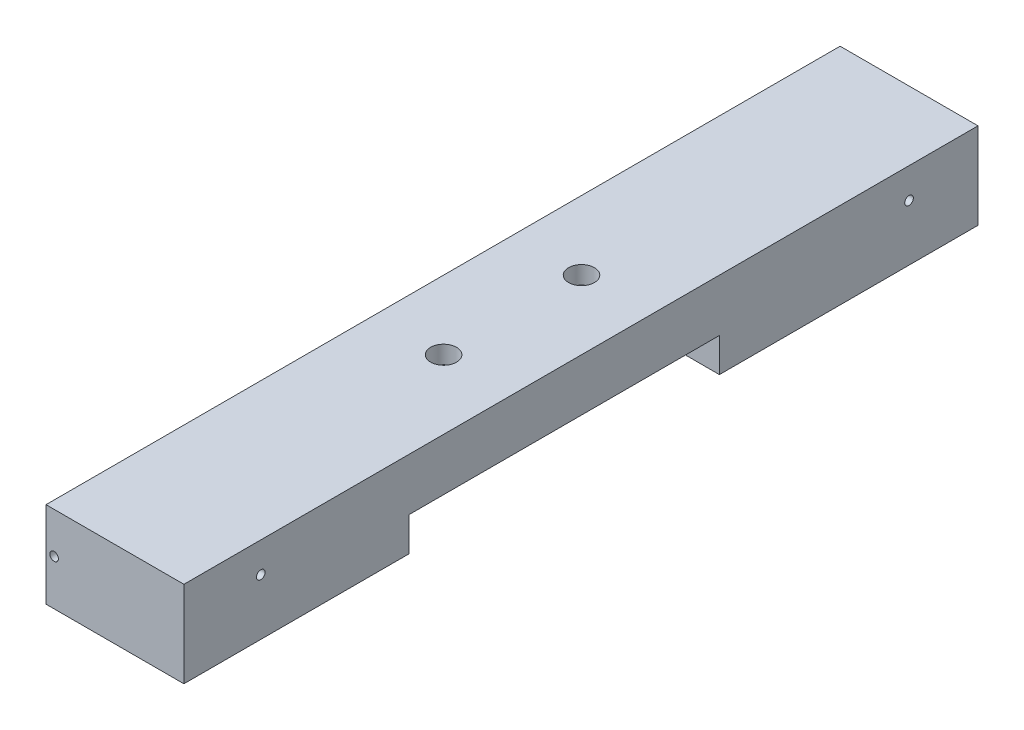
ISO-10303-21;
HEADER;
FILE_DESCRIPTION(('STEP AP214'),'2;1');
FILE_NAME('part.step','',(''),(''),'','','');
FILE_SCHEMA(('AUTOMOTIVE_DESIGN { 1 0 10303 214 1 1 1 1 }'));
ENDSEC;
DATA;
#1=APPLICATION_CONTEXT('core data for automotive mechanical design processes');
#2=APPLICATION_PROTOCOL_DEFINITION('international standard','automotive_design',2000,#1);
#3=PRODUCT_CONTEXT('',#1,'mechanical');
#4=PRODUCT('Part','Part','',(#3));
#5=PRODUCT_RELATED_PRODUCT_CATEGORY('part','',(#4));
#6=PRODUCT_DEFINITION_FORMATION('','',#4);
#7=PRODUCT_DEFINITION_CONTEXT('part definition',#1,'design');
#8=PRODUCT_DEFINITION('design','',#6,#7);
#9=PRODUCT_DEFINITION_SHAPE('','',#8);
#10=(LENGTH_UNIT() NAMED_UNIT(*) SI_UNIT(.MILLI.,.METRE.));
#11=(NAMED_UNIT(*) PLANE_ANGLE_UNIT() SI_UNIT($,.RADIAN.));
#12=(NAMED_UNIT(*) SI_UNIT($,.STERADIAN.) SOLID_ANGLE_UNIT());
#13=UNCERTAINTY_MEASURE_WITH_UNIT(LENGTH_MEASURE(1.E-05),#10,'distance_accuracy_value','');
#14=(GEOMETRIC_REPRESENTATION_CONTEXT(3) GLOBAL_UNCERTAINTY_ASSIGNED_CONTEXT((#13)) GLOBAL_UNIT_ASSIGNED_CONTEXT((#10,
#11,#12)) REPRESENTATION_CONTEXT('',''));
#15=CARTESIAN_POINT('',(0.,0.,0.));
#16=DIRECTION('',(0.,0.,1.));
#17=DIRECTION('',(1.,0.,0.));
#18=AXIS2_PLACEMENT_3D('',#15,#16,#17);
#19=CARTESIAN_POINT('',(50.8,63.5,241.3));
#20=DIRECTION('',(0.,-1.,0.));
#21=DIRECTION('',(0.,0.,-1.));
#22=AXIS2_PLACEMENT_3D('',#19,#20,#21);
#23=CYLINDRICAL_SURFACE('',#22,4.93435191606347);
#24=CARTESIAN_POINT('',(50.8,24.9999999999998,241.3));
#25=DIRECTION('',(0.,-1.,0.));
#26=DIRECTION('',(0.,0.,-1.));
#27=AXIS2_PLACEMENT_3D('',#24,#25,#26);
#28=CIRCLE('',#27,4.93435191606347);
#29=CARTESIAN_POINT('',(50.8,24.9999999999998,236.365648083937));
#30=VERTEX_POINT('',#29);
#31=EDGE_CURVE('E165',#30,#30,#28,.T.);
#32=ORIENTED_EDGE('',*,*,#31,.T.);
#33=EDGE_LOOP('',(#32));
#34=FACE_BOUND('',#33,.T.);
#35=CARTESIAN_POINT('',(50.8,50.4000000000003,241.3));
#36=DIRECTION('',(0.,1.,0.));
#37=DIRECTION('',(-1.,0.,0.));
#38=AXIS2_PLACEMENT_3D('',#35,#36,#37);
#39=CIRCLE('',#38,4.93435191606347);
#40=CARTESIAN_POINT('',(45.8656480839365,50.4000000000003,241.3));
#41=VERTEX_POINT('',#40);
#42=EDGE_CURVE('E39',#41,#41,#39,.F.);
#43=ORIENTED_EDGE('',*,*,#42,.F.);
#44=EDGE_LOOP('',(#43));
#45=FACE_BOUND('',#44,.T.);
#46=ADVANCED_FACE('F35',(#34,#45),#23,.F.);
#47=CARTESIAN_POINT('',(50.8,63.5,342.9));
#48=DIRECTION('',(0.,-1.,0.));
#49=DIRECTION('',(0.,0.,-1.));
#50=AXIS2_PLACEMENT_3D('',#47,#48,#49);
#51=CYLINDRICAL_SURFACE('',#50,4.93435191606347);
#52=CARTESIAN_POINT('',(50.8,24.9999999999998,342.9));
#53=DIRECTION('',(0.,-1.,0.));
#54=DIRECTION('',(0.,0.,-1.));
#55=AXIS2_PLACEMENT_3D('',#52,#53,#54);
#56=CIRCLE('',#55,4.93435191606347);
#57=CARTESIAN_POINT('',(50.8,24.9999999999998,337.965648083937));
#58=VERTEX_POINT('',#57);
#59=EDGE_CURVE('E174',#58,#58,#56,.T.);
#60=ORIENTED_EDGE('',*,*,#59,.T.);
#61=EDGE_LOOP('',(#60));
#62=FACE_BOUND('',#61,.T.);
#63=CARTESIAN_POINT('',(50.8,50.4000000000003,342.9));
#64=DIRECTION('',(0.,1.,0.));
#65=DIRECTION('',(-1.,0.,0.));
#66=AXIS2_PLACEMENT_3D('',#63,#64,#65);
#67=CIRCLE('',#66,4.93435191606347);
#68=CARTESIAN_POINT('',(45.8656480839365,50.4000000000003,342.9));
#69=VERTEX_POINT('',#68);
#70=EDGE_CURVE('E135',#69,#69,#67,.F.);
#71=ORIENTED_EDGE('',*,*,#70,.F.);
#72=EDGE_LOOP('',(#71));
#73=FACE_BOUND('',#72,.T.);
#74=ADVANCED_FACE('F330',(#62,#73),#51,.F.);
#75=CARTESIAN_POINT('',(0.,0.,585.0001));
#76=DIRECTION('',(0.,1.,0.));
#77=DIRECTION('',(0.,0.,1.));
#78=AXIS2_PLACEMENT_3D('',#75,#76,#77);
#79=PLANE('',#78);
#80=DIRECTION('',(0.,0.,-1.));
#81=VECTOR('',#80,1.);
#82=CARTESIAN_POINT('',(101.6,0.,585.0001));
#83=LINE('',#82,#81);
#84=CARTESIAN_POINT('',(101.6,0.,190.5));
#85=VERTEX_POINT('',#84);
#86=CARTESIAN_POINT('',(101.6,0.,0.));
#87=VERTEX_POINT('',#86);
#88=EDGE_CURVE('E130',#85,#87,#83,.T.);
#89=ORIENTED_EDGE('',*,*,#88,.F.);
#90=DIRECTION('',(-1.,0.,0.));
#91=VECTOR('',#90,1.);
#92=CARTESIAN_POINT('',(101.6,0.,190.5));
#93=LINE('',#92,#91);
#94=CARTESIAN_POINT('',(0.,0.,190.5));
#95=VERTEX_POINT('',#94);
#96=EDGE_CURVE('E278',#85,#95,#93,.T.);
#97=ORIENTED_EDGE('',*,*,#96,.T.);
#98=DIRECTION('',(0.,0.,-1.));
#99=VECTOR('',#98,1.);
#100=CARTESIAN_POINT('',(0.,0.,585.0001));
#101=LINE('',#100,#99);
#102=CARTESIAN_POINT('',(0.,0.,0.));
#103=VERTEX_POINT('',#102);
#104=EDGE_CURVE('E44',#95,#103,#101,.T.);
#105=ORIENTED_EDGE('',*,*,#104,.T.);
#106=DIRECTION('',(1.,0.,0.));
#107=VECTOR('',#106,1.);
#108=CARTESIAN_POINT('',(0.,0.,0.));
#109=LINE('',#108,#107);
#110=EDGE_CURVE('E293',#103,#87,#109,.T.);
#111=ORIENTED_EDGE('',*,*,#110,.T.);
#112=EDGE_LOOP('',(#89,#97,#105,#111));
#113=FACE_BOUND('',#112,.T.);
#114=ADVANCED_FACE('F311',(#113),#79,.F.);
#115=CARTESIAN_POINT('',(0.,0.,585.0001));
#116=DIRECTION('',(1.,0.,0.));
#117=DIRECTION('',(0.,0.,-1.));
#118=AXIS2_PLACEMENT_3D('',#115,#116,#117);
#119=PLANE('',#118);
#120=CARTESIAN_POINT('',(0.,56.5000000000009,566.000000000002));
#121=DIRECTION('',(1.,0.,0.));
#122=DIRECTION('',(0.,0.,-1.));
#123=AXIS2_PLACEMENT_3D('',#120,#121,#122);
#124=CIRCLE('',#123,3.30000000000003);
#125=CARTESIAN_POINT('',(0.,56.5000000000009,562.700000000002));
#126=VERTEX_POINT('',#125);
#127=EDGE_CURVE('E183',#126,#126,#124,.T.);
#128=ORIENTED_EDGE('',*,*,#127,.T.);
#129=EDGE_LOOP('',(#128));
#130=FACE_BOUND('',#129,.T.);
#131=CARTESIAN_POINT('',(0.,10.5000000000009,566.000000000002));
#132=DIRECTION('',(1.,0.,0.));
#133=DIRECTION('',(0.,0.,-1.));
#134=AXIS2_PLACEMENT_3D('',#131,#132,#133);
#135=CIRCLE('',#134,3.30000000000003);
#136=CARTESIAN_POINT('',(0.,10.5000000000009,562.700000000002));
#137=VERTEX_POINT('',#136);
#138=EDGE_CURVE('E190',#137,#137,#135,.T.);
#139=ORIENTED_EDGE('',*,*,#138,.T.);
#140=EDGE_LOOP('',(#139));
#141=FACE_BOUND('',#140,.T.);
#142=CARTESIAN_POINT('',(0.,10.5000000000009,579.000000000002));
#143=DIRECTION('',(1.,0.,0.));
#144=DIRECTION('',(0.,0.,-1.));
#145=AXIS2_PLACEMENT_3D('',#142,#143,#144);
#146=CIRCLE('',#145,3.30000000000003);
#147=CARTESIAN_POINT('',(0.,10.5000000000009,575.700000000002));
#148=VERTEX_POINT('',#147);
#149=EDGE_CURVE('E189',#148,#148,#146,.T.);
#150=ORIENTED_EDGE('',*,*,#149,.T.);
#151=EDGE_LOOP('',(#150));
#152=FACE_BOUND('',#151,.T.);
#153=CARTESIAN_POINT('',(0.,56.500000000001,10.000000000002));
#154=DIRECTION('',(1.,0.,0.));
#155=DIRECTION('',(0.,0.,-1.));
#156=AXIS2_PLACEMENT_3D('',#153,#154,#155);
#157=CIRCLE('',#156,3.3);
#158=CARTESIAN_POINT('',(0.,56.500000000001,6.70000000000199));
#159=VERTEX_POINT('',#158);
#160=EDGE_CURVE('E202',#159,#159,#157,.T.);
#161=ORIENTED_EDGE('',*,*,#160,.T.);
#162=EDGE_LOOP('',(#161));
#163=FACE_BOUND('',#162,.T.);
#164=CARTESIAN_POINT('',(0.,56.5000000000009,579.000000000002));
#165=DIRECTION('',(1.,0.,0.));
#166=DIRECTION('',(0.,0.,-1.));
#167=AXIS2_PLACEMENT_3D('',#164,#165,#166);
#168=CIRCLE('',#167,3.30000000000003);
#169=CARTESIAN_POINT('',(0.,56.5000000000009,575.700000000002));
#170=VERTEX_POINT('',#169);
#171=EDGE_CURVE('E177',#170,#170,#168,.T.);
#172=ORIENTED_EDGE('',*,*,#171,.T.);
#173=EDGE_LOOP('',(#172));
#174=FACE_BOUND('',#173,.T.);
#175=CARTESIAN_POINT('',(0.,10.500000000001,10.000000000002));
#176=DIRECTION('',(1.,0.,0.));
#177=DIRECTION('',(0.,0.,-1.));
#178=AXIS2_PLACEMENT_3D('',#175,#176,#177);
#179=CIRCLE('',#178,3.3);
#180=CARTESIAN_POINT('',(0.,10.500000000001,6.700000000002));
#181=VERTEX_POINT('',#180);
#182=EDGE_CURVE('E201',#181,#181,#179,.T.);
#183=ORIENTED_EDGE('',*,*,#182,.T.);
#184=EDGE_LOOP('',(#183));
#185=FACE_BOUND('',#184,.T.);
#186=CARTESIAN_POINT('',(0.,33.5000000000001,530.000000000002));
#187=DIRECTION('',(1.,0.,0.));
#188=DIRECTION('',(0.,0.,-1.));
#189=AXIS2_PLACEMENT_3D('',#186,#187,#188);
#190=CIRCLE('',#189,1.75);
#191=CARTESIAN_POINT('',(0.,33.5000000000001,528.250000000002));
#192=VERTEX_POINT('',#191);
#193=EDGE_CURVE('E220',#192,#192,#190,.T.);
#194=ORIENTED_EDGE('',*,*,#193,.T.);
#195=EDGE_LOOP('',(#194));
#196=FACE_BOUND('',#195,.T.);
#197=CARTESIAN_POINT('',(0.,33.5000000000001,470.000000000002));
#198=DIRECTION('',(1.,0.,0.));
#199=DIRECTION('',(0.,0.,-1.));
#200=AXIS2_PLACEMENT_3D('',#197,#198,#199);
#201=CIRCLE('',#200,1.75);
#202=CARTESIAN_POINT('',(0.,33.5000000000001,468.250000000002));
#203=VERTEX_POINT('',#202);
#204=EDGE_CURVE('E223',#203,#203,#201,.T.);
#205=ORIENTED_EDGE('',*,*,#204,.T.);
#206=EDGE_LOOP('',(#205));
#207=FACE_BOUND('',#206,.T.);
#208=CARTESIAN_POINT('',(0.,33.5000000000001,410.000000000002));
#209=DIRECTION('',(1.,0.,0.));
#210=DIRECTION('',(0.,0.,-1.));
#211=AXIS2_PLACEMENT_3D('',#208,#209,#210);
#212=CIRCLE('',#211,1.75);
#213=CARTESIAN_POINT('',(0.,33.5000000000001,408.250000000002));
#214=VERTEX_POINT('',#213);
#215=EDGE_CURVE('E229',#214,#214,#212,.T.);
#216=ORIENTED_EDGE('',*,*,#215,.T.);
#217=EDGE_LOOP('',(#216));
#218=FACE_BOUND('',#217,.T.);
#219=CARTESIAN_POINT('',(0.,33.5000000000001,350.000000000002));
#220=DIRECTION('',(1.,0.,0.));
#221=DIRECTION('',(0.,0.,-1.));
#222=AXIS2_PLACEMENT_3D('',#219,#220,#221);
#223=CIRCLE('',#222,1.75);
#224=CARTESIAN_POINT('',(0.,33.5000000000001,348.250000000002));
#225=VERTEX_POINT('',#224);
#226=EDGE_CURVE('E235',#225,#225,#223,.T.);
#227=ORIENTED_EDGE('',*,*,#226,.T.);
#228=EDGE_LOOP('',(#227));
#229=FACE_BOUND('',#228,.T.);
#230=CARTESIAN_POINT('',(0.,33.5000000000001,290.000000000002));
#231=DIRECTION('',(1.,0.,0.));
#232=DIRECTION('',(0.,0.,-1.));
#233=AXIS2_PLACEMENT_3D('',#230,#231,#232);
#234=CIRCLE('',#233,1.75);
#235=CARTESIAN_POINT('',(0.,33.5000000000001,288.250000000002));
#236=VERTEX_POINT('',#235);
#237=EDGE_CURVE('E241',#236,#236,#234,.T.);
#238=ORIENTED_EDGE('',*,*,#237,.T.);
#239=EDGE_LOOP('',(#238));
#240=FACE_BOUND('',#239,.T.);
#241=CARTESIAN_POINT('',(0.,33.5000000000001,230.000000000002));
#242=DIRECTION('',(1.,0.,0.));
#243=DIRECTION('',(0.,0.,-1.));
#244=AXIS2_PLACEMENT_3D('',#241,#242,#243);
#245=CIRCLE('',#244,1.75);
#246=CARTESIAN_POINT('',(0.,33.5000000000001,228.250000000002));
#247=VERTEX_POINT('',#246);
#248=EDGE_CURVE('E247',#247,#247,#245,.T.);
#249=ORIENTED_EDGE('',*,*,#248,.T.);
#250=EDGE_LOOP('',(#249));
#251=FACE_BOUND('',#250,.T.);
#252=CARTESIAN_POINT('',(0.,33.5000000000001,170.000000000002));
#253=DIRECTION('',(1.,0.,0.));
#254=DIRECTION('',(0.,0.,-1.));
#255=AXIS2_PLACEMENT_3D('',#252,#253,#254);
#256=CIRCLE('',#255,1.75);
#257=CARTESIAN_POINT('',(0.,33.5000000000001,168.250000000002));
#258=VERTEX_POINT('',#257);
#259=EDGE_CURVE('E253',#258,#258,#256,.T.);
#260=ORIENTED_EDGE('',*,*,#259,.T.);
#261=EDGE_LOOP('',(#260));
#262=FACE_BOUND('',#261,.T.);
#263=CARTESIAN_POINT('',(0.,33.5000000000001,110.000000000002));
#264=DIRECTION('',(1.,0.,0.));
#265=DIRECTION('',(0.,0.,-1.));
#266=AXIS2_PLACEMENT_3D('',#263,#264,#265);
#267=CIRCLE('',#266,1.75);
#268=CARTESIAN_POINT('',(0.,33.5000000000001,108.250000000002));
#269=VERTEX_POINT('',#268);
#270=EDGE_CURVE('E259',#269,#269,#267,.T.);
#271=ORIENTED_EDGE('',*,*,#270,.T.);
#272=EDGE_LOOP('',(#271));
#273=FACE_BOUND('',#272,.T.);
#274=CARTESIAN_POINT('',(0.,33.5000000000001,50.0000000000019));
#275=DIRECTION('',(1.,0.,0.));
#276=DIRECTION('',(0.,0.,-1.));
#277=AXIS2_PLACEMENT_3D('',#274,#275,#276);
#278=CIRCLE('',#277,1.75);
#279=CARTESIAN_POINT('',(0.,33.5000000000001,48.2500000000019));
#280=VERTEX_POINT('',#279);
#281=EDGE_CURVE('E265',#280,#280,#278,.T.);
#282=ORIENTED_EDGE('',*,*,#281,.T.);
#283=EDGE_LOOP('',(#282));
#284=FACE_BOUND('',#283,.T.);
#285=ORIENTED_EDGE('',*,*,#104,.F.);
#286=DIRECTION('',(0.,-1.,0.));
#287=VECTOR('',#286,1.);
#288=CARTESIAN_POINT('',(0.,0.,190.5));
#289=LINE('',#288,#287);
#290=CARTESIAN_POINT('',(0.,24.9999999999998,190.5));
#291=VERTEX_POINT('',#290);
#292=EDGE_CURVE('E119',#291,#95,#289,.T.);
#293=ORIENTED_EDGE('',*,*,#292,.F.);
#294=DIRECTION('',(0.,0.,-1.));
#295=VECTOR('',#294,1.);
#296=CARTESIAN_POINT('',(0.,24.9999999999998,190.5));
#297=LINE('',#296,#295);
#298=CARTESIAN_POINT('',(0.,24.9999999999998,419.1));
#299=VERTEX_POINT('',#298);
#300=EDGE_CURVE('E274',#299,#291,#297,.T.);
#301=ORIENTED_EDGE('',*,*,#300,.F.);
#302=DIRECTION('',(0.,1.,0.));
#303=VECTOR('',#302,1.);
#304=CARTESIAN_POINT('',(0.,24.9999999999998,419.1));
#305=LINE('',#304,#303);
#306=CARTESIAN_POINT('',(0.,0.,419.1));
#307=VERTEX_POINT('',#306);
#308=EDGE_CURVE('E219',#307,#299,#305,.T.);
#309=ORIENTED_EDGE('',*,*,#308,.F.);
#310=CARTESIAN_POINT('',(0.,0.,585.0001));
#311=VERTEX_POINT('',#310);
#312=EDGE_CURVE('E11',#311,#307,#101,.T.);
#313=ORIENTED_EDGE('',*,*,#312,.F.);
#314=DIRECTION('',(0.,-1.,0.));
#315=VECTOR('',#314,1.);
#316=CARTESIAN_POINT('',(0.,0.,585.0001));
#317=LINE('',#316,#315);
#318=CARTESIAN_POINT('',(0.,63.5,585.0001));
#319=VERTEX_POINT('',#318);
#320=EDGE_CURVE('E285',#319,#311,#317,.T.);
#321=ORIENTED_EDGE('',*,*,#320,.F.);
#322=DIRECTION('',(0.,0.,-1.));
#323=VECTOR('',#322,1.);
#324=CARTESIAN_POINT('',(0.,63.5,585.0001));
#325=LINE('',#324,#323);
#326=CARTESIAN_POINT('',(0.,63.5,0.));
#327=VERTEX_POINT('',#326);
#328=EDGE_CURVE('E290',#319,#327,#325,.T.);
#329=ORIENTED_EDGE('',*,*,#328,.T.);
#330=DIRECTION('',(0.,-1.,0.));
#331=VECTOR('',#330,1.);
#332=CARTESIAN_POINT('',(0.,0.,0.));
#333=LINE('',#332,#331);
#334=EDGE_CURVE('E281',#327,#103,#333,.T.);
#335=ORIENTED_EDGE('',*,*,#334,.T.);
#336=EDGE_LOOP('',(#285,#293,#301,#309,#313,#321,#329,#335));
#337=FACE_BOUND('',#336,.T.);
#338=ADVANCED_FACE('F37',(#130,#141,#152,#163,#174,#185,#196,#207,#218,#229,#240,#251,#262,#273,
#284,#337),#119,.F.);
#339=ORIENTED_EDGE('',*,*,#312,.T.);
#340=DIRECTION('',(-1.,0.,0.));
#341=VECTOR('',#340,1.);
#342=CARTESIAN_POINT('',(101.6,0.,419.1));
#343=LINE('',#342,#341);
#344=CARTESIAN_POINT('',(101.6,0.,419.1));
#345=VERTEX_POINT('',#344);
#346=EDGE_CURVE('E114',#345,#307,#343,.T.);
#347=ORIENTED_EDGE('',*,*,#346,.F.);
#348=CARTESIAN_POINT('',(101.6,0.,585.0001));
#349=VERTEX_POINT('',#348);
#350=EDGE_CURVE('E122',#349,#345,#83,.T.);
#351=ORIENTED_EDGE('',*,*,#350,.F.);
#352=DIRECTION('',(1.,0.,0.));
#353=VECTOR('',#352,1.);
#354=CARTESIAN_POINT('',(0.,0.,585.0001));
#355=LINE('',#354,#353);
#356=EDGE_CURVE('E89',#311,#349,#355,.T.);
#357=ORIENTED_EDGE('',*,*,#356,.F.);
#358=EDGE_LOOP('',(#339,#347,#351,#357));
#359=FACE_BOUND('',#358,.T.);
#360=ADVANCED_FACE('F121',(#359),#79,.F.);
#361=CARTESIAN_POINT('',(101.6,0.,585.0001));
#362=DIRECTION('',(-1.,0.,0.));
#363=DIRECTION('',(0.,0.,1.));
#364=AXIS2_PLACEMENT_3D('',#361,#362,#363);
#365=PLANE('',#364);
#366=CARTESIAN_POINT('',(101.6,41.2873800000008,50.8022026598419));
#367=DIRECTION('',(1.,0.,0.));
#368=DIRECTION('',(0.,0.,-1.));
#369=AXIS2_PLACEMENT_3D('',#366,#367,#368);
#370=CIRCLE('',#369,3.17499999999999);
#371=CARTESIAN_POINT('',(101.6,41.2873800000008,47.6272026598419));
#372=VERTEX_POINT('',#371);
#373=EDGE_CURVE('E166',#372,#372,#370,.T.);
#374=ORIENTED_EDGE('',*,*,#373,.F.);
#375=EDGE_LOOP('',(#374));
#376=FACE_BOUND('',#375,.T.);
#377=CARTESIAN_POINT('',(101.6,41.2873800000008,528.383982869842));
#378=DIRECTION('',(1.,0.,0.));
#379=DIRECTION('',(0.,0.,-1.));
#380=AXIS2_PLACEMENT_3D('',#377,#378,#379);
#381=CIRCLE('',#380,3.17500000000004);
#382=CARTESIAN_POINT('',(101.6,41.2873800000008,525.208982869842));
#383=VERTEX_POINT('',#382);
#384=EDGE_CURVE('E159',#383,#383,#381,.T.);
#385=ORIENTED_EDGE('',*,*,#384,.F.);
#386=EDGE_LOOP('',(#385));
#387=FACE_BOUND('',#386,.T.);
#388=DIRECTION('',(0.,0.,-1.));
#389=VECTOR('',#388,1.);
#390=CARTESIAN_POINT('',(101.6,24.9999999999998,190.5));
#391=LINE('',#390,#389);
#392=CARTESIAN_POINT('',(101.6,24.9999999999998,419.1));
#393=VERTEX_POINT('',#392);
#394=CARTESIAN_POINT('',(101.6,24.9999999999998,190.5));
#395=VERTEX_POINT('',#394);
#396=EDGE_CURVE('E52',#393,#395,#391,.T.);
#397=ORIENTED_EDGE('',*,*,#396,.T.);
#398=DIRECTION('',(0.,-1.,0.));
#399=VECTOR('',#398,1.);
#400=CARTESIAN_POINT('',(101.6,0.,190.5));
#401=LINE('',#400,#399);
#402=EDGE_CURVE('E125',#395,#85,#401,.T.);
#403=ORIENTED_EDGE('',*,*,#402,.T.);
#404=ORIENTED_EDGE('',*,*,#88,.T.);
#405=DIRECTION('',(0.,1.,0.));
#406=VECTOR('',#405,1.);
#407=CARTESIAN_POINT('',(101.6,0.,0.));
#408=LINE('',#407,#406);
#409=CARTESIAN_POINT('',(101.6,63.5,0.));
#410=VERTEX_POINT('',#409);
#411=EDGE_CURVE('E296',#87,#410,#408,.T.);
#412=ORIENTED_EDGE('',*,*,#411,.T.);
#413=DIRECTION('',(0.,0.,-1.));
#414=VECTOR('',#413,1.);
#415=CARTESIAN_POINT('',(101.6,63.5,585.0001));
#416=LINE('',#415,#414);
#417=CARTESIAN_POINT('',(101.6,63.5,585.0001));
#418=VERTEX_POINT('',#417);
#419=EDGE_CURVE('E132',#418,#410,#416,.T.);
#420=ORIENTED_EDGE('',*,*,#419,.F.);
#421=DIRECTION('',(0.,1.,0.));
#422=VECTOR('',#421,1.);
#423=CARTESIAN_POINT('',(101.6,0.,585.0001));
#424=LINE('',#423,#422);
#425=EDGE_CURVE('E129',#349,#418,#424,.T.);
#426=ORIENTED_EDGE('',*,*,#425,.F.);
#427=ORIENTED_EDGE('',*,*,#350,.T.);
#428=DIRECTION('',(0.,1.,0.));
#429=VECTOR('',#428,1.);
#430=CARTESIAN_POINT('',(101.6,24.9999999999998,419.1));
#431=LINE('',#430,#429);
#432=EDGE_CURVE('E110',#345,#393,#431,.T.);
#433=ORIENTED_EDGE('',*,*,#432,.T.);
#434=EDGE_LOOP('',(#397,#403,#404,#412,#420,#426,#427,#433));
#435=FACE_BOUND('',#434,.T.);
#436=ADVANCED_FACE('F127',(#376,#387,#435),#365,.F.);
#437=CARTESIAN_POINT('',(0.,63.5,585.0001));
#438=DIRECTION('',(0.,-1.,0.));
#439=DIRECTION('',(0.,0.,-1.));
#440=AXIS2_PLACEMENT_3D('',#437,#438,#439);
#441=PLANE('',#440);
#442=CARTESIAN_POINT('',(50.8000000000001,63.5,342.9));
#443=DIRECTION('',(0.,1.,0.));
#444=DIRECTION('',(-1.,0.,0.));
#445=AXIS2_PLACEMENT_3D('',#442,#443,#444);
#446=CIRCLE('',#445,9.525);
#447=CARTESIAN_POINT('',(41.2750000000001,63.5,342.9));
#448=VERTEX_POINT('',#447);
#449=EDGE_CURVE('E137',#448,#448,#446,.T.);
#450=ORIENTED_EDGE('',*,*,#449,.F.);
#451=EDGE_LOOP('',(#450));
#452=FACE_BOUND('',#451,.T.);
#453=CARTESIAN_POINT('',(50.8,63.5,241.3));
#454=DIRECTION('',(0.,1.,0.));
#455=DIRECTION('',(-1.,0.,0.));
#456=AXIS2_PLACEMENT_3D('',#453,#454,#455);
#457=CIRCLE('',#456,9.525);
#458=CARTESIAN_POINT('',(41.275,63.5,241.3));
#459=VERTEX_POINT('',#458);
#460=EDGE_CURVE('E148',#459,#459,#457,.T.);
#461=ORIENTED_EDGE('',*,*,#460,.F.);
#462=EDGE_LOOP('',(#461));
#463=FACE_BOUND('',#462,.T.);
#464=DIRECTION('',(-1.,0.,0.));
#465=VECTOR('',#464,1.);
#466=CARTESIAN_POINT('',(0.,63.5,0.));
#467=LINE('',#466,#465);
#468=EDGE_CURVE('E82',#410,#327,#467,.T.);
#469=ORIENTED_EDGE('',*,*,#468,.T.);
#470=ORIENTED_EDGE('',*,*,#328,.F.);
#471=DIRECTION('',(-1.,0.,0.));
#472=VECTOR('',#471,1.);
#473=CARTESIAN_POINT('',(0.,63.5,585.0001));
#474=LINE('',#473,#472);
#475=EDGE_CURVE('E61',#418,#319,#474,.T.);
#476=ORIENTED_EDGE('',*,*,#475,.F.);
#477=ORIENTED_EDGE('',*,*,#419,.T.);
#478=EDGE_LOOP('',(#469,#470,#476,#477));
#479=FACE_BOUND('',#478,.T.);
#480=ADVANCED_FACE('F301',(#452,#463,#479),#441,.F.);
#481=CARTESIAN_POINT('',(0.,0.,585.0001));
#482=DIRECTION('',(0.,0.,-1.));
#483=DIRECTION('',(-1.,0.,0.));
#484=AXIS2_PLACEMENT_3D('',#481,#482,#483);
#485=PLANE('',#484);
#486=CARTESIAN_POINT('',(5.95000000000041,33.5000000000003,585.0001));
#487=DIRECTION('',(0.,0.,1.));
#488=DIRECTION('',(1.,0.,0.));
#489=AXIS2_PLACEMENT_3D('',#486,#487,#488);
#490=CIRCLE('',#489,3.175);
#491=CARTESIAN_POINT('',(9.12500000000041,33.5000000000003,585.0001));
#492=VERTEX_POINT('',#491);
#493=EDGE_CURVE('E141',#492,#492,#490,.T.);
#494=ORIENTED_EDGE('',*,*,#493,.F.);
#495=EDGE_LOOP('',(#494));
#496=FACE_BOUND('',#495,.T.);
#497=ORIENTED_EDGE('',*,*,#320,.T.);
#498=ORIENTED_EDGE('',*,*,#356,.T.);
#499=ORIENTED_EDGE('',*,*,#425,.T.);
#500=ORIENTED_EDGE('',*,*,#475,.T.);
#501=EDGE_LOOP('',(#497,#498,#499,#500));
#502=FACE_BOUND('',#501,.T.);
#503=ADVANCED_FACE('F316',(#496,#502),#485,.F.);
#504=CARTESIAN_POINT('',(0.,0.,0.));
#505=DIRECTION('',(0.,0.,-1.));
#506=DIRECTION('',(-1.,0.,0.));
#507=AXIS2_PLACEMENT_3D('',#504,#505,#506);
#508=PLANE('',#507);
#509=ORIENTED_EDGE('',*,*,#334,.F.);
#510=ORIENTED_EDGE('',*,*,#468,.F.);
#511=ORIENTED_EDGE('',*,*,#411,.F.);
#512=ORIENTED_EDGE('',*,*,#110,.F.);
#513=EDGE_LOOP('',(#509,#510,#511,#512));
#514=FACE_BOUND('',#513,.T.);
#515=ADVANCED_FACE('F304',(#514),#508,.T.);
#516=CARTESIAN_POINT('',(101.6,0.,190.5));
#517=DIRECTION('',(0.,0.,-1.));
#518=DIRECTION('',(-1.,0.,0.));
#519=AXIS2_PLACEMENT_3D('',#516,#517,#518);
#520=PLANE('',#519);
#521=ORIENTED_EDGE('',*,*,#292,.T.);
#522=ORIENTED_EDGE('',*,*,#96,.F.);
#523=ORIENTED_EDGE('',*,*,#402,.F.);
#524=DIRECTION('',(-1.,0.,0.));
#525=VECTOR('',#524,1.);
#526=CARTESIAN_POINT('',(101.6,24.9999999999998,190.5));
#527=LINE('',#526,#525);
#528=EDGE_CURVE('E282',#395,#291,#527,.T.);
#529=ORIENTED_EDGE('',*,*,#528,.T.);
#530=EDGE_LOOP('',(#521,#522,#523,#529));
#531=FACE_BOUND('',#530,.T.);
#532=ADVANCED_FACE('F314',(#531),#520,.F.);
#533=CARTESIAN_POINT('',(101.6,24.9999999999998,190.5));
#534=DIRECTION('',(0.,1.,0.));
#535=DIRECTION('',(0.,0.,1.));
#536=AXIS2_PLACEMENT_3D('',#533,#534,#535);
#537=PLANE('',#536);
#538=ORIENTED_EDGE('',*,*,#59,.F.);
#539=EDGE_LOOP('',(#538));
#540=FACE_BOUND('',#539,.T.);
#541=ORIENTED_EDGE('',*,*,#31,.F.);
#542=EDGE_LOOP('',(#541));
#543=FACE_BOUND('',#542,.T.);
#544=ORIENTED_EDGE('',*,*,#300,.T.);
#545=ORIENTED_EDGE('',*,*,#528,.F.);
#546=ORIENTED_EDGE('',*,*,#396,.F.);
#547=DIRECTION('',(-1.,0.,0.));
#548=VECTOR('',#547,1.);
#549=CARTESIAN_POINT('',(101.6,24.9999999999998,419.1));
#550=LINE('',#549,#548);
#551=EDGE_CURVE('E116',#393,#299,#550,.T.);
#552=ORIENTED_EDGE('',*,*,#551,.T.);
#553=EDGE_LOOP('',(#544,#545,#546,#552));
#554=FACE_BOUND('',#553,.T.);
#555=ADVANCED_FACE('F315',(#540,#543,#554),#537,.F.);
#556=CARTESIAN_POINT('',(101.6,24.9999999999998,419.1));
#557=DIRECTION('',(0.,0.,1.));
#558=DIRECTION('',(1.,0.,0.));
#559=AXIS2_PLACEMENT_3D('',#556,#557,#558);
#560=PLANE('',#559);
#561=ORIENTED_EDGE('',*,*,#308,.T.);
#562=ORIENTED_EDGE('',*,*,#551,.F.);
#563=ORIENTED_EDGE('',*,*,#432,.F.);
#564=ORIENTED_EDGE('',*,*,#346,.T.);
#565=EDGE_LOOP('',(#561,#562,#563,#564));
#566=FACE_BOUND('',#565,.T.);
#567=ADVANCED_FACE('F113',(#566),#560,.F.);
#568=CARTESIAN_POINT('',(6.35,33.5000000000001,50.0000000000019));
#569=DIRECTION('',(-1.,0.,0.));
#570=DIRECTION('',(0.,0.,1.));
#571=AXIS2_PLACEMENT_3D('',#568,#569,#570);
#572=CYLINDRICAL_SURFACE('',#571,1.75);
#573=ORIENTED_EDGE('',*,*,#281,.F.);
#574=EDGE_LOOP('',(#573));
#575=FACE_BOUND('',#574,.T.);
#576=CARTESIAN_POINT('',(6.35,33.5000000000001,50.0000000000019));
#577=DIRECTION('',(1.,0.,0.));
#578=DIRECTION('',(0.,0.,-1.));
#579=AXIS2_PLACEMENT_3D('',#576,#577,#578);
#580=CIRCLE('',#579,1.75);
#581=CARTESIAN_POINT('',(6.35,33.5000000000001,48.2500000000019));
#582=VERTEX_POINT('',#581);
#583=EDGE_CURVE('E213',#582,#582,#580,.T.);
#584=ORIENTED_EDGE('',*,*,#583,.T.);
#585=EDGE_LOOP('',(#584));
#586=FACE_BOUND('',#585,.T.);
#587=ADVANCED_FACE('F455',(#575,#586),#572,.F.);
#588=CARTESIAN_POINT('',(6.35,33.5000000000001,50.0000000000019));
#589=DIRECTION('',(1.,0.,0.));
#590=DIRECTION('',(0.,0.,-1.));
#591=AXIS2_PLACEMENT_3D('',#588,#589,#590);
#592=PLANE('',#591);
#593=ORIENTED_EDGE('',*,*,#583,.F.);
#594=EDGE_LOOP('',(#593));
#595=FACE_BOUND('',#594,.T.);
#596=ADVANCED_FACE('F450',(#595),#592,.F.);
#597=CARTESIAN_POINT('',(6.35,33.5000000000001,110.000000000002));
#598=DIRECTION('',(-1.,0.,0.));
#599=DIRECTION('',(0.,0.,1.));
#600=AXIS2_PLACEMENT_3D('',#597,#598,#599);
#601=CYLINDRICAL_SURFACE('',#600,1.75);
#602=ORIENTED_EDGE('',*,*,#270,.F.);
#603=EDGE_LOOP('',(#602));
#604=FACE_BOUND('',#603,.T.);
#605=CARTESIAN_POINT('',(6.35,33.5000000000001,110.000000000002));
#606=DIRECTION('',(1.,0.,0.));
#607=DIRECTION('',(0.,0.,-1.));
#608=AXIS2_PLACEMENT_3D('',#605,#606,#607);
#609=CIRCLE('',#608,1.75);
#610=CARTESIAN_POINT('',(6.35,33.5000000000001,108.250000000002));
#611=VERTEX_POINT('',#610);
#612=EDGE_CURVE('E262',#611,#611,#609,.T.);
#613=ORIENTED_EDGE('',*,*,#612,.T.);
#614=EDGE_LOOP('',(#613));
#615=FACE_BOUND('',#614,.T.);
#616=ADVANCED_FACE('F447',(#604,#615),#601,.F.);
#617=CARTESIAN_POINT('',(6.35,33.5000000000001,110.000000000002));
#618=DIRECTION('',(1.,0.,0.));
#619=DIRECTION('',(0.,0.,-1.));
#620=AXIS2_PLACEMENT_3D('',#617,#618,#619);
#621=PLANE('',#620);
#622=ORIENTED_EDGE('',*,*,#612,.F.);
#623=EDGE_LOOP('',(#622));
#624=FACE_BOUND('',#623,.T.);
#625=ADVANCED_FACE('F442',(#624),#621,.F.);
#626=CARTESIAN_POINT('',(6.35,33.5000000000001,170.000000000002));
#627=DIRECTION('',(-1.,0.,0.));
#628=DIRECTION('',(0.,0.,1.));
#629=AXIS2_PLACEMENT_3D('',#626,#627,#628);
#630=CYLINDRICAL_SURFACE('',#629,1.75);
#631=ORIENTED_EDGE('',*,*,#259,.F.);
#632=EDGE_LOOP('',(#631));
#633=FACE_BOUND('',#632,.T.);
#634=CARTESIAN_POINT('',(6.35,33.5000000000001,170.000000000002));
#635=DIRECTION('',(1.,0.,0.));
#636=DIRECTION('',(0.,0.,-1.));
#637=AXIS2_PLACEMENT_3D('',#634,#635,#636);
#638=CIRCLE('',#637,1.75);
#639=CARTESIAN_POINT('',(6.35,33.5000000000001,168.250000000002));
#640=VERTEX_POINT('',#639);
#641=EDGE_CURVE('E256',#640,#640,#638,.T.);
#642=ORIENTED_EDGE('',*,*,#641,.T.);
#643=EDGE_LOOP('',(#642));
#644=FACE_BOUND('',#643,.T.);
#645=ADVANCED_FACE('F439',(#633,#644),#630,.F.);
#646=CARTESIAN_POINT('',(6.35,33.5000000000001,170.000000000002));
#647=DIRECTION('',(1.,0.,0.));
#648=DIRECTION('',(0.,0.,-1.));
#649=AXIS2_PLACEMENT_3D('',#646,#647,#648);
#650=PLANE('',#649);
#651=ORIENTED_EDGE('',*,*,#641,.F.);
#652=EDGE_LOOP('',(#651));
#653=FACE_BOUND('',#652,.T.);
#654=ADVANCED_FACE('F434',(#653),#650,.F.);
#655=CARTESIAN_POINT('',(6.35,33.5000000000001,230.000000000002));
#656=DIRECTION('',(-1.,0.,0.));
#657=DIRECTION('',(0.,0.,1.));
#658=AXIS2_PLACEMENT_3D('',#655,#656,#657);
#659=CYLINDRICAL_SURFACE('',#658,1.75);
#660=ORIENTED_EDGE('',*,*,#248,.F.);
#661=EDGE_LOOP('',(#660));
#662=FACE_BOUND('',#661,.T.);
#663=CARTESIAN_POINT('',(6.35,33.5000000000001,230.000000000002));
#664=DIRECTION('',(1.,0.,0.));
#665=DIRECTION('',(0.,0.,-1.));
#666=AXIS2_PLACEMENT_3D('',#663,#664,#665);
#667=CIRCLE('',#666,1.75);
#668=CARTESIAN_POINT('',(6.35,33.5000000000001,228.250000000002));
#669=VERTEX_POINT('',#668);
#670=EDGE_CURVE('E250',#669,#669,#667,.T.);
#671=ORIENTED_EDGE('',*,*,#670,.T.);
#672=EDGE_LOOP('',(#671));
#673=FACE_BOUND('',#672,.T.);
#674=ADVANCED_FACE('F431',(#662,#673),#659,.F.);
#675=CARTESIAN_POINT('',(6.35,33.5000000000001,230.000000000002));
#676=DIRECTION('',(1.,0.,0.));
#677=DIRECTION('',(0.,0.,-1.));
#678=AXIS2_PLACEMENT_3D('',#675,#676,#677);
#679=PLANE('',#678);
#680=ORIENTED_EDGE('',*,*,#670,.F.);
#681=EDGE_LOOP('',(#680));
#682=FACE_BOUND('',#681,.T.);
#683=ADVANCED_FACE('F426',(#682),#679,.F.);
#684=CARTESIAN_POINT('',(6.35,33.5000000000001,290.000000000002));
#685=DIRECTION('',(-1.,0.,0.));
#686=DIRECTION('',(0.,0.,1.));
#687=AXIS2_PLACEMENT_3D('',#684,#685,#686);
#688=CYLINDRICAL_SURFACE('',#687,1.75);
#689=ORIENTED_EDGE('',*,*,#237,.F.);
#690=EDGE_LOOP('',(#689));
#691=FACE_BOUND('',#690,.T.);
#692=CARTESIAN_POINT('',(6.35,33.5000000000001,290.000000000002));
#693=DIRECTION('',(1.,0.,0.));
#694=DIRECTION('',(0.,0.,-1.));
#695=AXIS2_PLACEMENT_3D('',#692,#693,#694);
#696=CIRCLE('',#695,1.75);
#697=CARTESIAN_POINT('',(6.35,33.5000000000001,288.250000000002));
#698=VERTEX_POINT('',#697);
#699=EDGE_CURVE('E244',#698,#698,#696,.T.);
#700=ORIENTED_EDGE('',*,*,#699,.T.);
#701=EDGE_LOOP('',(#700));
#702=FACE_BOUND('',#701,.T.);
#703=ADVANCED_FACE('F423',(#691,#702),#688,.F.);
#704=CARTESIAN_POINT('',(6.35,33.5000000000001,290.000000000002));
#705=DIRECTION('',(1.,0.,0.));
#706=DIRECTION('',(0.,0.,-1.));
#707=AXIS2_PLACEMENT_3D('',#704,#705,#706);
#708=PLANE('',#707);
#709=ORIENTED_EDGE('',*,*,#699,.F.);
#710=EDGE_LOOP('',(#709));
#711=FACE_BOUND('',#710,.T.);
#712=ADVANCED_FACE('F418',(#711),#708,.F.);
#713=CARTESIAN_POINT('',(6.35,33.5000000000001,350.000000000002));
#714=DIRECTION('',(-1.,0.,0.));
#715=DIRECTION('',(0.,0.,1.));
#716=AXIS2_PLACEMENT_3D('',#713,#714,#715);
#717=CYLINDRICAL_SURFACE('',#716,1.75);
#718=ORIENTED_EDGE('',*,*,#226,.F.);
#719=EDGE_LOOP('',(#718));
#720=FACE_BOUND('',#719,.T.);
#721=CARTESIAN_POINT('',(6.35,33.5000000000001,350.000000000002));
#722=DIRECTION('',(1.,0.,0.));
#723=DIRECTION('',(0.,0.,-1.));
#724=AXIS2_PLACEMENT_3D('',#721,#722,#723);
#725=CIRCLE('',#724,1.75);
#726=CARTESIAN_POINT('',(6.35,33.5000000000001,348.250000000002));
#727=VERTEX_POINT('',#726);
#728=EDGE_CURVE('E238',#727,#727,#725,.T.);
#729=ORIENTED_EDGE('',*,*,#728,.T.);
#730=EDGE_LOOP('',(#729));
#731=FACE_BOUND('',#730,.T.);
#732=ADVANCED_FACE('F415',(#720,#731),#717,.F.);
#733=CARTESIAN_POINT('',(6.35,33.5000000000001,350.000000000002));
#734=DIRECTION('',(1.,0.,0.));
#735=DIRECTION('',(0.,0.,-1.));
#736=AXIS2_PLACEMENT_3D('',#733,#734,#735);
#737=PLANE('',#736);
#738=ORIENTED_EDGE('',*,*,#728,.F.);
#739=EDGE_LOOP('',(#738));
#740=FACE_BOUND('',#739,.T.);
#741=ADVANCED_FACE('F410',(#740),#737,.F.);
#742=CARTESIAN_POINT('',(6.35,33.5000000000001,410.000000000002));
#743=DIRECTION('',(-1.,0.,0.));
#744=DIRECTION('',(0.,0.,1.));
#745=AXIS2_PLACEMENT_3D('',#742,#743,#744);
#746=CYLINDRICAL_SURFACE('',#745,1.75);
#747=ORIENTED_EDGE('',*,*,#215,.F.);
#748=EDGE_LOOP('',(#747));
#749=FACE_BOUND('',#748,.T.);
#750=CARTESIAN_POINT('',(6.35,33.5000000000001,410.000000000002));
#751=DIRECTION('',(1.,0.,0.));
#752=DIRECTION('',(0.,0.,-1.));
#753=AXIS2_PLACEMENT_3D('',#750,#751,#752);
#754=CIRCLE('',#753,1.75);
#755=CARTESIAN_POINT('',(6.35,33.5000000000001,408.250000000002));
#756=VERTEX_POINT('',#755);
#757=EDGE_CURVE('E232',#756,#756,#754,.T.);
#758=ORIENTED_EDGE('',*,*,#757,.T.);
#759=EDGE_LOOP('',(#758));
#760=FACE_BOUND('',#759,.T.);
#761=ADVANCED_FACE('F407',(#749,#760),#746,.F.);
#762=CARTESIAN_POINT('',(6.35,33.5000000000001,410.000000000002));
#763=DIRECTION('',(1.,0.,0.));
#764=DIRECTION('',(0.,0.,-1.));
#765=AXIS2_PLACEMENT_3D('',#762,#763,#764);
#766=PLANE('',#765);
#767=ORIENTED_EDGE('',*,*,#757,.F.);
#768=EDGE_LOOP('',(#767));
#769=FACE_BOUND('',#768,.T.);
#770=ADVANCED_FACE('F402',(#769),#766,.F.);
#771=CARTESIAN_POINT('',(6.35,33.5000000000001,470.000000000002));
#772=DIRECTION('',(-1.,0.,0.));
#773=DIRECTION('',(0.,0.,1.));
#774=AXIS2_PLACEMENT_3D('',#771,#772,#773);
#775=CYLINDRICAL_SURFACE('',#774,1.75);
#776=ORIENTED_EDGE('',*,*,#204,.F.);
#777=EDGE_LOOP('',(#776));
#778=FACE_BOUND('',#777,.T.);
#779=CARTESIAN_POINT('',(6.35,33.5000000000001,470.000000000002));
#780=DIRECTION('',(1.,0.,0.));
#781=DIRECTION('',(0.,0.,-1.));
#782=AXIS2_PLACEMENT_3D('',#779,#780,#781);
#783=CIRCLE('',#782,1.75);
#784=CARTESIAN_POINT('',(6.35,33.5000000000001,468.250000000002));
#785=VERTEX_POINT('',#784);
#786=EDGE_CURVE('E226',#785,#785,#783,.T.);
#787=ORIENTED_EDGE('',*,*,#786,.T.);
#788=EDGE_LOOP('',(#787));
#789=FACE_BOUND('',#788,.T.);
#790=ADVANCED_FACE('F399',(#778,#789),#775,.F.);
#791=CARTESIAN_POINT('',(6.35,33.5000000000001,470.000000000002));
#792=DIRECTION('',(1.,0.,0.));
#793=DIRECTION('',(0.,0.,-1.));
#794=AXIS2_PLACEMENT_3D('',#791,#792,#793);
#795=PLANE('',#794);
#796=ORIENTED_EDGE('',*,*,#786,.F.);
#797=EDGE_LOOP('',(#796));
#798=FACE_BOUND('',#797,.T.);
#799=ADVANCED_FACE('F397',(#798),#795,.F.);
#800=CARTESIAN_POINT('',(6.35,33.5000000000001,530.000000000002));
#801=DIRECTION('',(-1.,0.,0.));
#802=DIRECTION('',(0.,0.,1.));
#803=AXIS2_PLACEMENT_3D('',#800,#801,#802);
#804=CYLINDRICAL_SURFACE('',#803,1.75);
#805=ORIENTED_EDGE('',*,*,#193,.F.);
#806=EDGE_LOOP('',(#805));
#807=FACE_BOUND('',#806,.T.);
#808=CARTESIAN_POINT('',(6.35,33.5000000000001,530.000000000002));
#809=DIRECTION('',(1.,0.,0.));
#810=DIRECTION('',(0.,0.,-1.));
#811=AXIS2_PLACEMENT_3D('',#808,#809,#810);
#812=CIRCLE('',#811,1.75);
#813=CARTESIAN_POINT('',(6.35,33.5000000000001,528.250000000002));
#814=VERTEX_POINT('',#813);
#815=EDGE_CURVE('E216',#814,#814,#812,.T.);
#816=ORIENTED_EDGE('',*,*,#815,.T.);
#817=EDGE_LOOP('',(#816));
#818=FACE_BOUND('',#817,.T.);
#819=ADVANCED_FACE('F393',(#807,#818),#804,.F.);
#820=CARTESIAN_POINT('',(6.35,33.5000000000001,530.000000000002));
#821=DIRECTION('',(1.,0.,0.));
#822=DIRECTION('',(0.,0.,-1.));
#823=AXIS2_PLACEMENT_3D('',#820,#821,#822);
#824=PLANE('',#823);
#825=ORIENTED_EDGE('',*,*,#815,.F.);
#826=EDGE_LOOP('',(#825));
#827=FACE_BOUND('',#826,.T.);
#828=ADVANCED_FACE('F389',(#827),#824,.F.);
#829=CARTESIAN_POINT('',(25.4,10.500000000001,10.000000000002));
#830=DIRECTION('',(-1.,0.,0.));
#831=DIRECTION('',(0.,0.,1.));
#832=AXIS2_PLACEMENT_3D('',#829,#830,#831);
#833=CYLINDRICAL_SURFACE('',#832,3.3);
#834=CARTESIAN_POINT('',(25.4,10.500000000001,10.000000000002));
#835=DIRECTION('',(1.,0.,0.));
#836=DIRECTION('',(0.,0.,-1.));
#837=AXIS2_PLACEMENT_3D('',#834,#835,#836);
#838=CIRCLE('',#837,3.3);
#839=CARTESIAN_POINT('',(25.4,10.500000000001,6.700000000002));
#840=VERTEX_POINT('',#839);
#841=EDGE_CURVE('E210',#840,#840,#838,.T.);
#842=ORIENTED_EDGE('',*,*,#841,.T.);
#843=EDGE_LOOP('',(#842));
#844=FACE_BOUND('',#843,.T.);
#845=ORIENTED_EDGE('',*,*,#182,.F.);
#846=EDGE_LOOP('',(#845));
#847=FACE_BOUND('',#846,.T.);
#848=ADVANCED_FACE('F385',(#844,#847),#833,.F.);
#849=CARTESIAN_POINT('',(25.4,10.500000000001,10.000000000002));
#850=DIRECTION('',(1.,0.,0.));
#851=DIRECTION('',(0.,0.,-1.));
#852=AXIS2_PLACEMENT_3D('',#849,#850,#851);
#853=PLANE('',#852);
#854=ORIENTED_EDGE('',*,*,#841,.F.);
#855=EDGE_LOOP('',(#854));
#856=FACE_BOUND('',#855,.T.);
#857=ADVANCED_FACE('F349',(#856),#853,.F.);
#858=CARTESIAN_POINT('',(25.4,56.5000000000009,579.000000000002));
#859=DIRECTION('',(-1.,0.,0.));
#860=DIRECTION('',(0.,0.,1.));
#861=AXIS2_PLACEMENT_3D('',#858,#859,#860);
#862=CYLINDRICAL_SURFACE('',#861,3.30000000000003);
#863=CARTESIAN_POINT('',(25.4,56.5000000000009,579.000000000002));
#864=DIRECTION('',(1.,0.,0.));
#865=DIRECTION('',(0.,0.,-1.));
#866=AXIS2_PLACEMENT_3D('',#863,#864,#865);
#867=CIRCLE('',#866,3.30000000000003);
#868=CARTESIAN_POINT('',(25.4,56.5000000000009,575.700000000002));
#869=VERTEX_POINT('',#868);
#870=EDGE_CURVE('E180',#869,#869,#867,.T.);
#871=ORIENTED_EDGE('',*,*,#870,.T.);
#872=EDGE_LOOP('',(#871));
#873=FACE_BOUND('',#872,.T.);
#874=ORIENTED_EDGE('',*,*,#171,.F.);
#875=EDGE_LOOP('',(#874));
#876=FACE_BOUND('',#875,.T.);
#877=ADVANCED_FACE('F345',(#873,#876),#862,.F.);
#878=CARTESIAN_POINT('',(25.4,56.5000000000009,579.000000000002));
#879=DIRECTION('',(1.,0.,0.));
#880=DIRECTION('',(0.,0.,-1.));
#881=AXIS2_PLACEMENT_3D('',#878,#879,#880);
#882=PLANE('',#881);
#883=ORIENTED_EDGE('',*,*,#870,.F.);
#884=EDGE_LOOP('',(#883));
#885=FACE_BOUND('',#884,.T.);
#886=ADVANCED_FACE('F341',(#885),#882,.F.);
#887=CARTESIAN_POINT('',(25.4,56.500000000001,10.000000000002));
#888=DIRECTION('',(-1.,0.,0.));
#889=DIRECTION('',(0.,0.,1.));
#890=AXIS2_PLACEMENT_3D('',#887,#888,#889);
#891=CYLINDRICAL_SURFACE('',#890,3.3);
#892=CARTESIAN_POINT('',(25.4,56.500000000001,10.000000000002));
#893=DIRECTION('',(1.,0.,0.));
#894=DIRECTION('',(0.,0.,-1.));
#895=AXIS2_PLACEMENT_3D('',#892,#893,#894);
#896=CIRCLE('',#895,3.3);
#897=CARTESIAN_POINT('',(25.4,56.500000000001,6.70000000000199));
#898=VERTEX_POINT('',#897);
#899=EDGE_CURVE('E198',#898,#898,#896,.T.);
#900=ORIENTED_EDGE('',*,*,#899,.T.);
#901=EDGE_LOOP('',(#900));
#902=FACE_BOUND('',#901,.T.);
#903=ORIENTED_EDGE('',*,*,#160,.F.);
#904=EDGE_LOOP('',(#903));
#905=FACE_BOUND('',#904,.T.);
#906=ADVANCED_FACE('F344',(#902,#905),#891,.F.);
#907=CARTESIAN_POINT('',(25.4,56.500000000001,10.000000000002));
#908=DIRECTION('',(1.,0.,0.));
#909=DIRECTION('',(0.,0.,-1.));
#910=AXIS2_PLACEMENT_3D('',#907,#908,#909);
#911=PLANE('',#910);
#912=ORIENTED_EDGE('',*,*,#899,.F.);
#913=EDGE_LOOP('',(#912));
#914=FACE_BOUND('',#913,.T.);
#915=ADVANCED_FACE('F369',(#914),#911,.F.);
#916=CARTESIAN_POINT('',(25.4,10.5000000000009,579.000000000002));
#917=DIRECTION('',(-1.,0.,0.));
#918=DIRECTION('',(0.,0.,1.));
#919=AXIS2_PLACEMENT_3D('',#916,#917,#918);
#920=CYLINDRICAL_SURFACE('',#919,3.30000000000003);
#921=CARTESIAN_POINT('',(25.4,10.5000000000009,579.000000000002));
#922=DIRECTION('',(1.,0.,0.));
#923=DIRECTION('',(0.,0.,-1.));
#924=AXIS2_PLACEMENT_3D('',#921,#922,#923);
#925=CIRCLE('',#924,3.30000000000003);
#926=CARTESIAN_POINT('',(25.4,10.5000000000009,575.700000000002));
#927=VERTEX_POINT('',#926);
#928=EDGE_CURVE('E205',#927,#927,#925,.T.);
#929=ORIENTED_EDGE('',*,*,#928,.T.);
#930=EDGE_LOOP('',(#929));
#931=FACE_BOUND('',#930,.T.);
#932=ORIENTED_EDGE('',*,*,#149,.F.);
#933=EDGE_LOOP('',(#932));
#934=FACE_BOUND('',#933,.T.);
#935=ADVANCED_FACE('F372',(#931,#934),#920,.F.);
#936=CARTESIAN_POINT('',(25.4,10.5000000000009,579.000000000002));
#937=DIRECTION('',(1.,0.,0.));
#938=DIRECTION('',(0.,0.,-1.));
#939=AXIS2_PLACEMENT_3D('',#936,#937,#938);
#940=PLANE('',#939);
#941=ORIENTED_EDGE('',*,*,#928,.F.);
#942=EDGE_LOOP('',(#941));
#943=FACE_BOUND('',#942,.T.);
#944=ADVANCED_FACE('F359',(#943),#940,.F.);
#945=CARTESIAN_POINT('',(25.4,10.5000000000009,566.000000000002));
#946=DIRECTION('',(-1.,0.,0.));
#947=DIRECTION('',(0.,0.,1.));
#948=AXIS2_PLACEMENT_3D('',#945,#946,#947);
#949=CYLINDRICAL_SURFACE('',#948,3.30000000000003);
#950=CARTESIAN_POINT('',(25.4,10.5000000000009,566.000000000002));
#951=DIRECTION('',(1.,0.,0.));
#952=DIRECTION('',(0.,0.,-1.));
#953=AXIS2_PLACEMENT_3D('',#950,#951,#952);
#954=CIRCLE('',#953,3.30000000000003);
#955=CARTESIAN_POINT('',(25.4,10.5000000000009,562.700000000002));
#956=VERTEX_POINT('',#955);
#957=EDGE_CURVE('E186',#956,#956,#954,.T.);
#958=ORIENTED_EDGE('',*,*,#957,.T.);
#959=EDGE_LOOP('',(#958));
#960=FACE_BOUND('',#959,.T.);
#961=ORIENTED_EDGE('',*,*,#138,.F.);
#962=EDGE_LOOP('',(#961));
#963=FACE_BOUND('',#962,.T.);
#964=ADVANCED_FACE('F355',(#960,#963),#949,.F.);
#965=CARTESIAN_POINT('',(25.4,10.5000000000009,566.000000000002));
#966=DIRECTION('',(1.,0.,0.));
#967=DIRECTION('',(0.,0.,-1.));
#968=AXIS2_PLACEMENT_3D('',#965,#966,#967);
#969=PLANE('',#968);
#970=ORIENTED_EDGE('',*,*,#957,.F.);
#971=EDGE_LOOP('',(#970));
#972=FACE_BOUND('',#971,.T.);
#973=ADVANCED_FACE('F351',(#972),#969,.F.);
#974=CARTESIAN_POINT('',(25.4,56.5000000000009,566.000000000002));
#975=DIRECTION('',(-1.,0.,0.));
#976=DIRECTION('',(0.,0.,1.));
#977=AXIS2_PLACEMENT_3D('',#974,#975,#976);
#978=CYLINDRICAL_SURFACE('',#977,3.30000000000003);
#979=CARTESIAN_POINT('',(25.4,56.5000000000009,566.000000000002));
#980=DIRECTION('',(1.,0.,0.));
#981=DIRECTION('',(0.,0.,-1.));
#982=AXIS2_PLACEMENT_3D('',#979,#980,#981);
#983=CIRCLE('',#982,3.30000000000003);
#984=CARTESIAN_POINT('',(25.4,56.5000000000009,562.700000000002));
#985=VERTEX_POINT('',#984);
#986=EDGE_CURVE('E193',#985,#985,#983,.T.);
#987=ORIENTED_EDGE('',*,*,#986,.T.);
#988=EDGE_LOOP('',(#987));
#989=FACE_BOUND('',#988,.T.);
#990=ORIENTED_EDGE('',*,*,#127,.F.);
#991=EDGE_LOOP('',(#990));
#992=FACE_BOUND('',#991,.T.);
#993=ADVANCED_FACE('F354',(#989,#992),#978,.F.);
#994=CARTESIAN_POINT('',(25.4,56.5000000000009,566.000000000002));
#995=DIRECTION('',(1.,0.,0.));
#996=DIRECTION('',(0.,0.,-1.));
#997=AXIS2_PLACEMENT_3D('',#994,#995,#996);
#998=PLANE('',#997);
#999=ORIENTED_EDGE('',*,*,#986,.F.);
#1000=EDGE_LOOP('',(#999));
#1001=FACE_BOUND('',#1000,.T.);
#1002=ADVANCED_FACE('F361',(#1001),#998,.F.);
#1003=CARTESIAN_POINT('',(88.9,41.2873800000008,528.383982869842));
#1004=DIRECTION('',(1.,0.,0.));
#1005=DIRECTION('',(0.,0.,-1.));
#1006=AXIS2_PLACEMENT_3D('',#1003,#1004,#1005);
#1007=CYLINDRICAL_SURFACE('',#1006,3.17500000000004);
#1008=ORIENTED_EDGE('',*,*,#384,.T.);
#1009=EDGE_LOOP('',(#1008));
#1010=FACE_BOUND('',#1009,.T.);
#1011=CARTESIAN_POINT('',(88.9,41.2873800000008,528.383982869842));
#1012=DIRECTION('',(1.,0.,0.));
#1013=DIRECTION('',(0.,0.,-1.));
#1014=AXIS2_PLACEMENT_3D('',#1011,#1012,#1013);
#1015=CIRCLE('',#1014,3.17499999999999);
#1016=CARTESIAN_POINT('',(88.9,41.2873800000008,525.208982869842));
#1017=VERTEX_POINT('',#1016);
#1018=EDGE_CURVE('E169',#1017,#1017,#1015,.T.);
#1019=ORIENTED_EDGE('',*,*,#1018,.F.);
#1020=EDGE_LOOP('',(#1019));
#1021=FACE_BOUND('',#1020,.T.);
#1022=ADVANCED_FACE('F364',(#1010,#1021),#1007,.F.);
#1023=CARTESIAN_POINT('',(88.9,41.2873800000008,528.383982869842));
#1024=DIRECTION('',(1.,0.,0.));
#1025=DIRECTION('',(0.,0.,-1.));
#1026=AXIS2_PLACEMENT_3D('',#1023,#1024,#1025);
#1027=PLANE('',#1026);
#1028=ORIENTED_EDGE('',*,*,#1018,.T.);
#1029=EDGE_LOOP('',(#1028));
#1030=FACE_BOUND('',#1029,.T.);
#1031=ADVANCED_FACE('F599',(#1030),#1027,.T.);
#1032=CARTESIAN_POINT('',(88.9,41.2873800000008,50.8022026598419));
#1033=DIRECTION('',(1.,0.,0.));
#1034=DIRECTION('',(0.,0.,-1.));
#1035=AXIS2_PLACEMENT_3D('',#1032,#1033,#1034);
#1036=CYLINDRICAL_SURFACE('',#1035,3.17499999999999);
#1037=ORIENTED_EDGE('',*,*,#373,.T.);
#1038=EDGE_LOOP('',(#1037));
#1039=FACE_BOUND('',#1038,.T.);
#1040=CARTESIAN_POINT('',(88.9,41.2873800000008,50.8022026598419));
#1041=DIRECTION('',(1.,0.,0.));
#1042=DIRECTION('',(0.,0.,-1.));
#1043=AXIS2_PLACEMENT_3D('',#1040,#1041,#1042);
#1044=CIRCLE('',#1043,3.17499999999997);
#1045=CARTESIAN_POINT('',(88.9,41.2873800000008,47.627202659842));
#1046=VERTEX_POINT('',#1045);
#1047=EDGE_CURVE('E162',#1046,#1046,#1044,.T.);
#1048=ORIENTED_EDGE('',*,*,#1047,.F.);
#1049=EDGE_LOOP('',(#1048));
#1050=FACE_BOUND('',#1049,.T.);
#1051=ADVANCED_FACE('F607',(#1039,#1050),#1036,.F.);
#1052=CARTESIAN_POINT('',(88.9,41.2873800000008,50.8022026598419));
#1053=DIRECTION('',(1.,0.,0.));
#1054=DIRECTION('',(0.,0.,-1.));
#1055=AXIS2_PLACEMENT_3D('',#1052,#1053,#1054);
#1056=PLANE('',#1055);
#1057=ORIENTED_EDGE('',*,*,#1047,.T.);
#1058=EDGE_LOOP('',(#1057));
#1059=FACE_BOUND('',#1058,.T.);
#1060=ADVANCED_FACE('F615',(#1059),#1056,.T.);
#1061=CARTESIAN_POINT('',(5.95000000000041,33.5000000000003,572.3001));
#1062=DIRECTION('',(0.,0.,1.));
#1063=DIRECTION('',(1.,0.,0.));
#1064=AXIS2_PLACEMENT_3D('',#1061,#1062,#1063);
#1065=CYLINDRICAL_SURFACE('',#1064,3.175);
#1066=CARTESIAN_POINT('',(5.95000000000041,33.5000000000003,572.3001));
#1067=DIRECTION('',(0.,0.,1.));
#1068=DIRECTION('',(1.,0.,0.));
#1069=AXIS2_PLACEMENT_3D('',#1066,#1067,#1068);
#1070=CIRCLE('',#1069,3.175);
#1071=CARTESIAN_POINT('',(9.12500000000041,33.5000000000003,572.3001));
#1072=VERTEX_POINT('',#1071);
#1073=EDGE_CURVE('E156',#1072,#1072,#1070,.T.);
#1074=ORIENTED_EDGE('',*,*,#1073,.F.);
#1075=EDGE_LOOP('',(#1074));
#1076=FACE_BOUND('',#1075,.T.);
#1077=ORIENTED_EDGE('',*,*,#493,.T.);
#1078=EDGE_LOOP('',(#1077));
#1079=FACE_BOUND('',#1078,.T.);
#1080=ADVANCED_FACE('F623',(#1076,#1079),#1065,.F.);
#1081=CARTESIAN_POINT('',(5.95000000000041,33.5000000000003,572.3001));
#1082=DIRECTION('',(0.,0.,1.));
#1083=DIRECTION('',(1.,0.,0.));
#1084=AXIS2_PLACEMENT_3D('',#1081,#1082,#1083);
#1085=PLANE('',#1084);
#1086=ORIENTED_EDGE('',*,*,#1073,.T.);
#1087=EDGE_LOOP('',(#1086));
#1088=FACE_BOUND('',#1087,.T.);
#1089=ADVANCED_FACE('F631',(#1088),#1085,.T.);
#1090=CARTESIAN_POINT('',(50.8000000000001,50.4000000000003,342.9));
#1091=DIRECTION('',(0.,1.,0.));
#1092=DIRECTION('',(-1.,0.,0.));
#1093=AXIS2_PLACEMENT_3D('',#1090,#1091,#1092);
#1094=PLANE('',#1093);
#1095=CARTESIAN_POINT('',(50.8000000000001,50.4000000000003,342.9));
#1096=DIRECTION('',(0.,1.,0.));
#1097=DIRECTION('',(-1.,0.,0.));
#1098=AXIS2_PLACEMENT_3D('',#1095,#1096,#1097);
#1099=CIRCLE('',#1098,9.525);
#1100=CARTESIAN_POINT('',(41.2750000000001,50.4000000000003,342.9));
#1101=VERTEX_POINT('',#1100);
#1102=EDGE_CURVE('E143',#1101,#1101,#1099,.T.);
#1103=ORIENTED_EDGE('',*,*,#1102,.T.);
#1104=EDGE_LOOP('',(#1103));
#1105=FACE_BOUND('',#1104,.T.);
#1106=ORIENTED_EDGE('',*,*,#70,.T.);
#1107=EDGE_LOOP('',(#1106));
#1108=FACE_BOUND('',#1107,.T.);
#1109=ADVANCED_FACE('F639',(#1105,#1108),#1094,.T.);
#1110=CARTESIAN_POINT('',(50.8000000000001,63.5,342.9));
#1111=DIRECTION('',(0.,-1.,0.));
#1112=DIRECTION('',(1.,0.,0.));
#1113=AXIS2_PLACEMENT_3D('',#1110,#1111,#1112);
#1114=CYLINDRICAL_SURFACE('',#1113,9.525);
#1115=ORIENTED_EDGE('',*,*,#449,.T.);
#1116=EDGE_LOOP('',(#1115));
#1117=FACE_BOUND('',#1116,.T.);
#1118=ORIENTED_EDGE('',*,*,#1102,.F.);
#1119=EDGE_LOOP('',(#1118));
#1120=FACE_BOUND('',#1119,.T.);
#1121=ADVANCED_FACE('F647',(#1117,#1120),#1114,.F.);
#1122=CARTESIAN_POINT('',(50.8,50.4000000000003,241.3));
#1123=DIRECTION('',(0.,1.,0.));
#1124=DIRECTION('',(-1.,0.,0.));
#1125=AXIS2_PLACEMENT_3D('',#1122,#1123,#1124);
#1126=PLANE('',#1125);
#1127=CARTESIAN_POINT('',(50.8,50.4000000000003,241.3));
#1128=DIRECTION('',(0.,1.,0.));
#1129=DIRECTION('',(-1.,0.,0.));
#1130=AXIS2_PLACEMENT_3D('',#1127,#1128,#1129);
#1131=CIRCLE('',#1130,9.525);
#1132=CARTESIAN_POINT('',(41.275,50.4000000000003,241.3));
#1133=VERTEX_POINT('',#1132);
#1134=EDGE_CURVE('E153',#1133,#1133,#1131,.T.);
#1135=ORIENTED_EDGE('',*,*,#1134,.T.);
#1136=EDGE_LOOP('',(#1135));
#1137=FACE_BOUND('',#1136,.T.);
#1138=ORIENTED_EDGE('',*,*,#42,.T.);
#1139=EDGE_LOOP('',(#1138));
#1140=FACE_BOUND('',#1139,.T.);
#1141=ADVANCED_FACE('F656',(#1137,#1140),#1126,.T.);
#1142=CARTESIAN_POINT('',(50.8,63.5,241.3));
#1143=DIRECTION('',(0.,-1.,0.));
#1144=DIRECTION('',(1.,0.,0.));
#1145=AXIS2_PLACEMENT_3D('',#1142,#1143,#1144);
#1146=CYLINDRICAL_SURFACE('',#1145,9.525);
#1147=ORIENTED_EDGE('',*,*,#460,.T.);
#1148=EDGE_LOOP('',(#1147));
#1149=FACE_BOUND('',#1148,.T.);
#1150=ORIENTED_EDGE('',*,*,#1134,.F.);
#1151=EDGE_LOOP('',(#1150));
#1152=FACE_BOUND('',#1151,.T.);
#1153=ADVANCED_FACE('F663',(#1149,#1152),#1146,.F.);
#1154=CLOSED_SHELL('',(#46,#74,#114,#338,#360,#436,#480,#503,#515,#532,#555,#567,#587,#596,#616,
#625,#645,#654,#674,#683,#703,#712,#732,#741,#761,#770,#790,#799,#819,#828,#848,#857,#877,#886,
#906,#915,#935,#944,#964,#973,#993,#1002,#1022,#1031,#1051,#1060,#1080,#1089,#1109,#1121,#1141,#1153));
#1155=MANIFOLD_SOLID_BREP('B2',#1154);
#1156=ADVANCED_BREP_SHAPE_REPRESENTATION('',(#18,#1155),#14);
#1157=SHAPE_DEFINITION_REPRESENTATION(#9,#1156);
ENDSEC;
END-ISO-10303-21;
